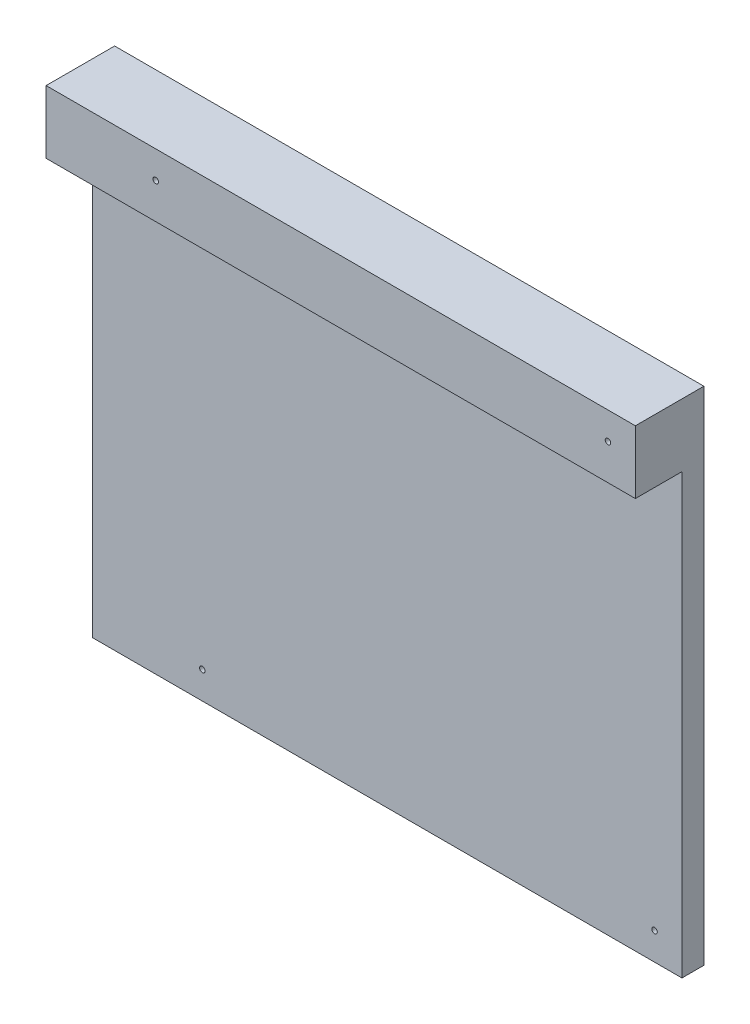
ISO-10303-21;
HEADER;
FILE_DESCRIPTION(('STEP AP214'),'2;1');
FILE_NAME('part.step','',(''),(''),'','','');
FILE_SCHEMA(('AUTOMOTIVE_DESIGN { 1 0 10303 214 1 1 1 1 }'));
ENDSEC;
DATA;
#1=APPLICATION_CONTEXT('core data for automotive mechanical design processes');
#2=APPLICATION_PROTOCOL_DEFINITION('international standard','automotive_design',2000,#1);
#3=PRODUCT_CONTEXT('',#1,'mechanical');
#4=PRODUCT('Part','Part','',(#3));
#5=PRODUCT_RELATED_PRODUCT_CATEGORY('part','',(#4));
#6=PRODUCT_DEFINITION_FORMATION('','',#4);
#7=PRODUCT_DEFINITION_CONTEXT('part definition',#1,'design');
#8=PRODUCT_DEFINITION('design','',#6,#7);
#9=PRODUCT_DEFINITION_SHAPE('','',#8);
#10=(LENGTH_UNIT() NAMED_UNIT(*) SI_UNIT(.MILLI.,.METRE.));
#11=(NAMED_UNIT(*) PLANE_ANGLE_UNIT() SI_UNIT($,.RADIAN.));
#12=(NAMED_UNIT(*) SI_UNIT($,.STERADIAN.) SOLID_ANGLE_UNIT());
#13=UNCERTAINTY_MEASURE_WITH_UNIT(LENGTH_MEASURE(1.E-05),#10,'distance_accuracy_value','');
#14=(GEOMETRIC_REPRESENTATION_CONTEXT(3) GLOBAL_UNCERTAINTY_ASSIGNED_CONTEXT((#13)) GLOBAL_UNIT_ASSIGNED_CONTEXT((#10,
#11,#12)) REPRESENTATION_CONTEXT('',''));
#15=CARTESIAN_POINT('',(0.,0.,0.));
#16=DIRECTION('',(0.,0.,1.));
#17=DIRECTION('',(1.,0.,0.));
#18=AXIS2_PLACEMENT_3D('',#15,#16,#17);
#19=CARTESIAN_POINT('',(180.749006663672,0.,8.));
#20=DIRECTION('',(1.,0.,0.));
#21=DIRECTION('',(0.,1.,0.));
#22=AXIS2_PLACEMENT_3D('',#19,#20,#21);
#23=PLANE('',#22);
#24=DIRECTION('',(0.,-1.,0.));
#25=VECTOR('',#24,1.);
#26=CARTESIAN_POINT('',(180.749006663672,0.,0.));
#27=LINE('',#26,#25);
#28=CARTESIAN_POINT('',(180.749006663672,26.8505076142132,0.));
#29=VERTEX_POINT('',#28);
#30=CARTESIAN_POINT('',(180.749006663672,-156.149492385787,0.));
#31=VERTEX_POINT('',#30);
#32=EDGE_CURVE('E130',#29,#31,#27,.T.);
#33=ORIENTED_EDGE('',*,*,#32,.F.);
#34=DIRECTION('',(0.,0.,-1.));
#35=VECTOR('',#34,1.);
#36=CARTESIAN_POINT('',(180.749006663672,26.8505076142132,25.));
#37=LINE('',#36,#35);
#38=CARTESIAN_POINT('',(180.749006663672,26.8505076142132,25.));
#39=VERTEX_POINT('',#38);
#40=EDGE_CURVE('E104',#39,#29,#37,.T.);
#41=ORIENTED_EDGE('',*,*,#40,.F.);
#42=DIRECTION('',(0.,-1.,0.));
#43=VECTOR('',#42,1.);
#44=CARTESIAN_POINT('',(180.749006663672,0.,25.));
#45=LINE('',#44,#43);
#46=CARTESIAN_POINT('',(180.749006663672,3.85050761421321,25.));
#47=VERTEX_POINT('',#46);
#48=EDGE_CURVE('E199',#39,#47,#45,.T.);
#49=ORIENTED_EDGE('',*,*,#48,.T.);
#50=DIRECTION('',(0.,0.,-1.));
#51=VECTOR('',#50,1.);
#52=CARTESIAN_POINT('',(180.749006663672,3.85050761421321,25.));
#53=LINE('',#52,#51);
#54=CARTESIAN_POINT('',(180.749006663672,3.85050761421321,8.));
#55=VERTEX_POINT('',#54);
#56=EDGE_CURVE('E101',#47,#55,#53,.T.);
#57=ORIENTED_EDGE('',*,*,#56,.T.);
#58=DIRECTION('',(0.,-1.,0.));
#59=VECTOR('',#58,1.);
#60=CARTESIAN_POINT('',(180.749006663672,0.,8.));
#61=LINE('',#60,#59);
#62=CARTESIAN_POINT('',(180.749006663672,-156.149492385787,8.));
#63=VERTEX_POINT('',#62);
#64=EDGE_CURVE('E72',#55,#63,#61,.T.);
#65=ORIENTED_EDGE('',*,*,#64,.T.);
#66=DIRECTION('',(0.,0.,-1.));
#67=VECTOR('',#66,1.);
#68=CARTESIAN_POINT('',(180.749006663672,-156.149492385787,8.));
#69=LINE('',#68,#67);
#70=EDGE_CURVE('E45',#63,#31,#69,.T.);
#71=ORIENTED_EDGE('',*,*,#70,.T.);
#72=EDGE_LOOP('',(#33,#41,#49,#57,#65,#71));
#73=FACE_BOUND('',#72,.T.);
#74=ADVANCED_FACE('F35',(#73),#23,.T.);
#75=CARTESIAN_POINT('',(-34.2509933363276,0.,8.));
#76=DIRECTION('',(1.,0.,0.));
#77=DIRECTION('',(0.,1.,0.));
#78=AXIS2_PLACEMENT_3D('',#75,#76,#77);
#79=PLANE('',#78);
#80=DIRECTION('',(0.,-1.,0.));
#81=VECTOR('',#80,1.);
#82=CARTESIAN_POINT('',(-34.2509933363276,0.,0.));
#83=LINE('',#82,#81);
#84=CARTESIAN_POINT('',(-34.2509933363276,26.8505076142132,0.));
#85=VERTEX_POINT('',#84);
#86=CARTESIAN_POINT('',(-34.2509933363276,-156.149492385787,0.));
#87=VERTEX_POINT('',#86);
#88=EDGE_CURVE('E136',#85,#87,#83,.T.);
#89=ORIENTED_EDGE('',*,*,#88,.T.);
#90=DIRECTION('',(0.,0.,-1.));
#91=VECTOR('',#90,1.);
#92=CARTESIAN_POINT('',(-34.2509933363276,-156.149492385787,8.));
#93=LINE('',#92,#91);
#94=CARTESIAN_POINT('',(-34.2509933363276,-156.149492385787,8.));
#95=VERTEX_POINT('',#94);
#96=EDGE_CURVE('E11',#95,#87,#93,.T.);
#97=ORIENTED_EDGE('',*,*,#96,.F.);
#98=DIRECTION('',(0.,-1.,0.));
#99=VECTOR('',#98,1.);
#100=CARTESIAN_POINT('',(-34.2509933363276,0.,8.));
#101=LINE('',#100,#99);
#102=CARTESIAN_POINT('',(-34.2509933363276,3.85050761421321,8.));
#103=VERTEX_POINT('',#102);
#104=EDGE_CURVE('E84',#103,#95,#101,.T.);
#105=ORIENTED_EDGE('',*,*,#104,.F.);
#106=DIRECTION('',(0.,0.,-1.));
#107=VECTOR('',#106,1.);
#108=CARTESIAN_POINT('',(-34.2509933363276,3.85050761421321,25.));
#109=LINE('',#108,#107);
#110=CARTESIAN_POINT('',(-34.2509933363276,3.85050761421321,25.));
#111=VERTEX_POINT('',#110);
#112=EDGE_CURVE('E89',#111,#103,#109,.T.);
#113=ORIENTED_EDGE('',*,*,#112,.F.);
#114=DIRECTION('',(0.,-1.,0.));
#115=VECTOR('',#114,1.);
#116=CARTESIAN_POINT('',(-34.2509933363276,0.,25.));
#117=LINE('',#116,#115);
#118=CARTESIAN_POINT('',(-34.2509933363276,26.8505076142132,25.));
#119=VERTEX_POINT('',#118);
#120=EDGE_CURVE('E195',#119,#111,#117,.T.);
#121=ORIENTED_EDGE('',*,*,#120,.F.);
#122=DIRECTION('',(0.,0.,-1.));
#123=VECTOR('',#122,1.);
#124=CARTESIAN_POINT('',(-34.2509933363276,26.8505076142132,25.));
#125=LINE('',#124,#123);
#126=EDGE_CURVE('E100',#119,#85,#125,.T.);
#127=ORIENTED_EDGE('',*,*,#126,.T.);
#128=EDGE_LOOP('',(#89,#97,#105,#113,#121,#127));
#129=FACE_BOUND('',#128,.T.);
#130=ADVANCED_FACE('F86',(#129),#79,.F.);
#131=CARTESIAN_POINT('',(170.749006663672,-146.149492385787,8.));
#132=DIRECTION('',(0.,0.,-1.));
#133=DIRECTION('',(-1.,0.,0.));
#134=AXIS2_PLACEMENT_3D('',#131,#132,#133);
#135=CYLINDRICAL_SURFACE('',#134,0.999999999999998);
#136=CARTESIAN_POINT('',(170.749006663672,-146.149492385787,8.));
#137=DIRECTION('',(0.,0.,1.));
#138=DIRECTION('',(1.,0.,0.));
#139=AXIS2_PLACEMENT_3D('',#136,#137,#138);
#140=CIRCLE('',#139,0.999999999999998);
#141=CARTESIAN_POINT('',(171.749006663672,-146.149492385787,8.));
#142=VERTEX_POINT('',#141);
#143=EDGE_CURVE('E142',#142,#142,#140,.T.);
#144=ORIENTED_EDGE('',*,*,#143,.T.);
#145=EDGE_LOOP('',(#144));
#146=FACE_BOUND('',#145,.T.);
#147=CARTESIAN_POINT('',(170.749006663672,-146.149492385787,0.));
#148=DIRECTION('',(0.,0.,1.));
#149=DIRECTION('',(1.,0.,0.));
#150=AXIS2_PLACEMENT_3D('',#147,#148,#149);
#151=CIRCLE('',#150,0.999999999999998);
#152=CARTESIAN_POINT('',(171.749006663672,-146.149492385787,0.));
#153=VERTEX_POINT('',#152);
#154=EDGE_CURVE('E125',#153,#153,#151,.T.);
#155=ORIENTED_EDGE('',*,*,#154,.F.);
#156=EDGE_LOOP('',(#155));
#157=FACE_BOUND('',#156,.T.);
#158=ADVANCED_FACE('F170',(#146,#157),#135,.F.);
#159=CARTESIAN_POINT('',(5.74900666367239,-146.149492385787,8.));
#160=DIRECTION('',(0.,0.,-1.));
#161=DIRECTION('',(-1.,0.,0.));
#162=AXIS2_PLACEMENT_3D('',#159,#160,#161);
#163=CYLINDRICAL_SURFACE('',#162,1.);
#164=CARTESIAN_POINT('',(5.74900666367239,-146.149492385787,8.));
#165=DIRECTION('',(0.,0.,1.));
#166=DIRECTION('',(1.,0.,0.));
#167=AXIS2_PLACEMENT_3D('',#164,#165,#166);
#168=CIRCLE('',#167,1.);
#169=CARTESIAN_POINT('',(6.74900666367239,-146.149492385787,8.));
#170=VERTEX_POINT('',#169);
#171=EDGE_CURVE('E111',#170,#170,#168,.T.);
#172=ORIENTED_EDGE('',*,*,#171,.T.);
#173=EDGE_LOOP('',(#172));
#174=FACE_BOUND('',#173,.T.);
#175=CARTESIAN_POINT('',(5.74900666367239,-146.149492385787,0.));
#176=DIRECTION('',(0.,0.,1.));
#177=DIRECTION('',(1.,0.,0.));
#178=AXIS2_PLACEMENT_3D('',#175,#176,#177);
#179=CIRCLE('',#178,1.);
#180=CARTESIAN_POINT('',(6.74900666367239,-146.149492385787,0.));
#181=VERTEX_POINT('',#180);
#182=EDGE_CURVE('E117',#181,#181,#179,.T.);
#183=ORIENTED_EDGE('',*,*,#182,.F.);
#184=EDGE_LOOP('',(#183));
#185=FACE_BOUND('',#184,.T.);
#186=ADVANCED_FACE('F37',(#174,#185),#163,.F.);
#187=CARTESIAN_POINT('',(0.,-156.149492385787,8.));
#188=DIRECTION('',(0.,1.,0.));
#189=DIRECTION('',(0.,0.,1.));
#190=AXIS2_PLACEMENT_3D('',#187,#188,#189);
#191=PLANE('',#190);
#192=DIRECTION('',(1.,0.,0.));
#193=VECTOR('',#192,1.);
#194=CARTESIAN_POINT('',(0.,-156.149492385787,0.));
#195=LINE('',#194,#193);
#196=EDGE_CURVE('E66',#87,#31,#195,.T.);
#197=ORIENTED_EDGE('',*,*,#196,.T.);
#198=ORIENTED_EDGE('',*,*,#70,.F.);
#199=DIRECTION('',(1.,0.,0.));
#200=VECTOR('',#199,1.);
#201=CARTESIAN_POINT('',(0.,-156.149492385787,8.));
#202=LINE('',#201,#200);
#203=EDGE_CURVE('E54',#95,#63,#202,.T.);
#204=ORIENTED_EDGE('',*,*,#203,.F.);
#205=ORIENTED_EDGE('',*,*,#96,.T.);
#206=EDGE_LOOP('',(#197,#198,#204,#205));
#207=FACE_BOUND('',#206,.T.);
#208=ADVANCED_FACE('F154',(#207),#191,.F.);
#209=CARTESIAN_POINT('',(0.,0.,8.));
#210=DIRECTION('',(0.,0.,1.));
#211=DIRECTION('',(1.,0.,0.));
#212=AXIS2_PLACEMENT_3D('',#209,#210,#211);
#213=PLANE('',#212);
#214=ORIENTED_EDGE('',*,*,#171,.F.);
#215=EDGE_LOOP('',(#214));
#216=FACE_BOUND('',#215,.T.);
#217=ORIENTED_EDGE('',*,*,#143,.F.);
#218=EDGE_LOOP('',(#217));
#219=FACE_BOUND('',#218,.T.);
#220=ORIENTED_EDGE('',*,*,#64,.F.);
#221=DIRECTION('',(1.,0.,0.));
#222=VECTOR('',#221,1.);
#223=CARTESIAN_POINT('',(0.,3.85050761421321,8.));
#224=LINE('',#223,#222);
#225=EDGE_CURVE('E90',#103,#55,#224,.T.);
#226=ORIENTED_EDGE('',*,*,#225,.F.);
#227=ORIENTED_EDGE('',*,*,#104,.T.);
#228=ORIENTED_EDGE('',*,*,#203,.T.);
#229=EDGE_LOOP('',(#220,#226,#227,#228));
#230=FACE_BOUND('',#229,.T.);
#231=ADVANCED_FACE('F91',(#216,#219,#230),#213,.T.);
#232=CARTESIAN_POINT('',(0.,0.,0.));
#233=DIRECTION('',(0.,0.,1.));
#234=DIRECTION('',(1.,0.,0.));
#235=AXIS2_PLACEMENT_3D('',#232,#233,#234);
#236=PLANE('',#235);
#237=ORIENTED_EDGE('',*,*,#182,.T.);
#238=EDGE_LOOP('',(#237));
#239=FACE_BOUND('',#238,.T.);
#240=ORIENTED_EDGE('',*,*,#154,.T.);
#241=EDGE_LOOP('',(#240));
#242=FACE_BOUND('',#241,.T.);
#243=ORIENTED_EDGE('',*,*,#32,.T.);
#244=ORIENTED_EDGE('',*,*,#196,.F.);
#245=ORIENTED_EDGE('',*,*,#88,.F.);
#246=DIRECTION('',(1.,0.,0.));
#247=VECTOR('',#246,1.);
#248=CARTESIAN_POINT('',(0.,26.8505076142132,0.));
#249=LINE('',#248,#247);
#250=EDGE_CURVE('E189',#85,#29,#249,.T.);
#251=ORIENTED_EDGE('',*,*,#250,.T.);
#252=EDGE_LOOP('',(#243,#244,#245,#251));
#253=FACE_BOUND('',#252,.T.);
#254=CARTESIAN_POINT('',(5.74900666367237,16.8505076142132,0.));
#255=DIRECTION('',(0.,0.,1.));
#256=DIRECTION('',(1.,0.,0.));
#257=AXIS2_PLACEMENT_3D('',#254,#255,#256);
#258=CIRCLE('',#257,1.);
#259=CARTESIAN_POINT('',(6.74900666367237,16.8505076142132,0.));
#260=VERTEX_POINT('',#259);
#261=EDGE_CURVE('E184',#260,#260,#258,.T.);
#262=ORIENTED_EDGE('',*,*,#261,.T.);
#263=EDGE_LOOP('',(#262));
#264=FACE_BOUND('',#263,.T.);
#265=CARTESIAN_POINT('',(170.749006663672,16.8505076142132,0.));
#266=DIRECTION('',(0.,0.,1.));
#267=DIRECTION('',(1.,0.,0.));
#268=AXIS2_PLACEMENT_3D('',#265,#266,#267);
#269=CIRCLE('',#268,0.999999999999998);
#270=CARTESIAN_POINT('',(171.749006663672,16.8505076142132,0.));
#271=VERTEX_POINT('',#270);
#272=EDGE_CURVE('E187',#271,#271,#269,.T.);
#273=ORIENTED_EDGE('',*,*,#272,.T.);
#274=EDGE_LOOP('',(#273));
#275=FACE_BOUND('',#274,.T.);
#276=ADVANCED_FACE('F153',(#239,#242,#253,#264,#275),#236,.F.);
#277=CARTESIAN_POINT('',(0.,3.85050761421321,25.));
#278=DIRECTION('',(0.,1.,0.));
#279=DIRECTION('',(0.,0.,1.));
#280=AXIS2_PLACEMENT_3D('',#277,#278,#279);
#281=PLANE('',#280);
#282=ORIENTED_EDGE('',*,*,#112,.T.);
#283=ORIENTED_EDGE('',*,*,#225,.T.);
#284=ORIENTED_EDGE('',*,*,#56,.F.);
#285=DIRECTION('',(1.,0.,0.));
#286=VECTOR('',#285,1.);
#287=CARTESIAN_POINT('',(0.,3.85050761421321,25.));
#288=LINE('',#287,#286);
#289=EDGE_CURVE('E98',#111,#47,#288,.T.);
#290=ORIENTED_EDGE('',*,*,#289,.F.);
#291=EDGE_LOOP('',(#282,#283,#284,#290));
#292=FACE_BOUND('',#291,.T.);
#293=ADVANCED_FACE('F97',(#292),#281,.F.);
#294=CARTESIAN_POINT('',(0.,26.8505076142132,25.));
#295=DIRECTION('',(0.,1.,0.));
#296=DIRECTION('',(0.,0.,1.));
#297=AXIS2_PLACEMENT_3D('',#294,#295,#296);
#298=PLANE('',#297);
#299=ORIENTED_EDGE('',*,*,#250,.F.);
#300=ORIENTED_EDGE('',*,*,#126,.F.);
#301=DIRECTION('',(1.,0.,0.));
#302=VECTOR('',#301,1.);
#303=CARTESIAN_POINT('',(0.,26.8505076142132,25.));
#304=LINE('',#303,#302);
#305=EDGE_CURVE('E197',#119,#39,#304,.T.);
#306=ORIENTED_EDGE('',*,*,#305,.T.);
#307=ORIENTED_EDGE('',*,*,#40,.T.);
#308=EDGE_LOOP('',(#299,#300,#306,#307));
#309=FACE_BOUND('',#308,.T.);
#310=ADVANCED_FACE('F223',(#309),#298,.T.);
#311=CARTESIAN_POINT('',(170.749006663672,16.8505076142132,25.));
#312=DIRECTION('',(0.,0.,-1.));
#313=DIRECTION('',(-1.,0.,0.));
#314=AXIS2_PLACEMENT_3D('',#311,#312,#313);
#315=CYLINDRICAL_SURFACE('',#314,0.999999999999998);
#316=CARTESIAN_POINT('',(170.749006663672,16.8505076142132,25.));
#317=DIRECTION('',(0.,0.,1.));
#318=DIRECTION('',(1.,0.,0.));
#319=AXIS2_PLACEMENT_3D('',#316,#317,#318);
#320=CIRCLE('',#319,0.999999999999998);
#321=CARTESIAN_POINT('',(171.749006663672,16.8505076142132,25.));
#322=VERTEX_POINT('',#321);
#323=EDGE_CURVE('E202',#322,#322,#320,.T.);
#324=ORIENTED_EDGE('',*,*,#323,.T.);
#325=EDGE_LOOP('',(#324));
#326=FACE_BOUND('',#325,.T.);
#327=ORIENTED_EDGE('',*,*,#272,.F.);
#328=EDGE_LOOP('',(#327));
#329=FACE_BOUND('',#328,.T.);
#330=ADVANCED_FACE('F227',(#326,#329),#315,.F.);
#331=CARTESIAN_POINT('',(5.74900666367237,16.8505076142132,25.));
#332=DIRECTION('',(0.,0.,-1.));
#333=DIRECTION('',(-1.,0.,0.));
#334=AXIS2_PLACEMENT_3D('',#331,#332,#333);
#335=CYLINDRICAL_SURFACE('',#334,1.);
#336=CARTESIAN_POINT('',(5.74900666367237,16.8505076142132,25.));
#337=DIRECTION('',(0.,0.,1.));
#338=DIRECTION('',(1.,0.,0.));
#339=AXIS2_PLACEMENT_3D('',#336,#337,#338);
#340=CIRCLE('',#339,1.);
#341=CARTESIAN_POINT('',(6.74900666367237,16.8505076142132,25.));
#342=VERTEX_POINT('',#341);
#343=EDGE_CURVE('E191',#342,#342,#340,.T.);
#344=ORIENTED_EDGE('',*,*,#343,.T.);
#345=EDGE_LOOP('',(#344));
#346=FACE_BOUND('',#345,.T.);
#347=ORIENTED_EDGE('',*,*,#261,.F.);
#348=EDGE_LOOP('',(#347));
#349=FACE_BOUND('',#348,.T.);
#350=ADVANCED_FACE('F208',(#346,#349),#335,.F.);
#351=CARTESIAN_POINT('',(0.,0.,25.));
#352=DIRECTION('',(0.,0.,1.));
#353=DIRECTION('',(1.,0.,0.));
#354=AXIS2_PLACEMENT_3D('',#351,#352,#353);
#355=PLANE('',#354);
#356=ORIENTED_EDGE('',*,*,#343,.F.);
#357=EDGE_LOOP('',(#356));
#358=FACE_BOUND('',#357,.T.);
#359=ORIENTED_EDGE('',*,*,#323,.F.);
#360=EDGE_LOOP('',(#359));
#361=FACE_BOUND('',#360,.T.);
#362=ORIENTED_EDGE('',*,*,#48,.F.);
#363=ORIENTED_EDGE('',*,*,#305,.F.);
#364=ORIENTED_EDGE('',*,*,#120,.T.);
#365=ORIENTED_EDGE('',*,*,#289,.T.);
#366=EDGE_LOOP('',(#362,#363,#364,#365));
#367=FACE_BOUND('',#366,.T.);
#368=ADVANCED_FACE('F211',(#358,#361,#367),#355,.T.);
#369=CLOSED_SHELL('',(#74,#130,#158,#186,#208,#231,#276,#293,#310,#330,#350,#368));
#370=MANIFOLD_SOLID_BREP('B2',#369);
#371=ADVANCED_BREP_SHAPE_REPRESENTATION('',(#18,#370),#14);
#372=SHAPE_DEFINITION_REPRESENTATION(#9,#371);
ENDSEC;
END-ISO-10303-21;
